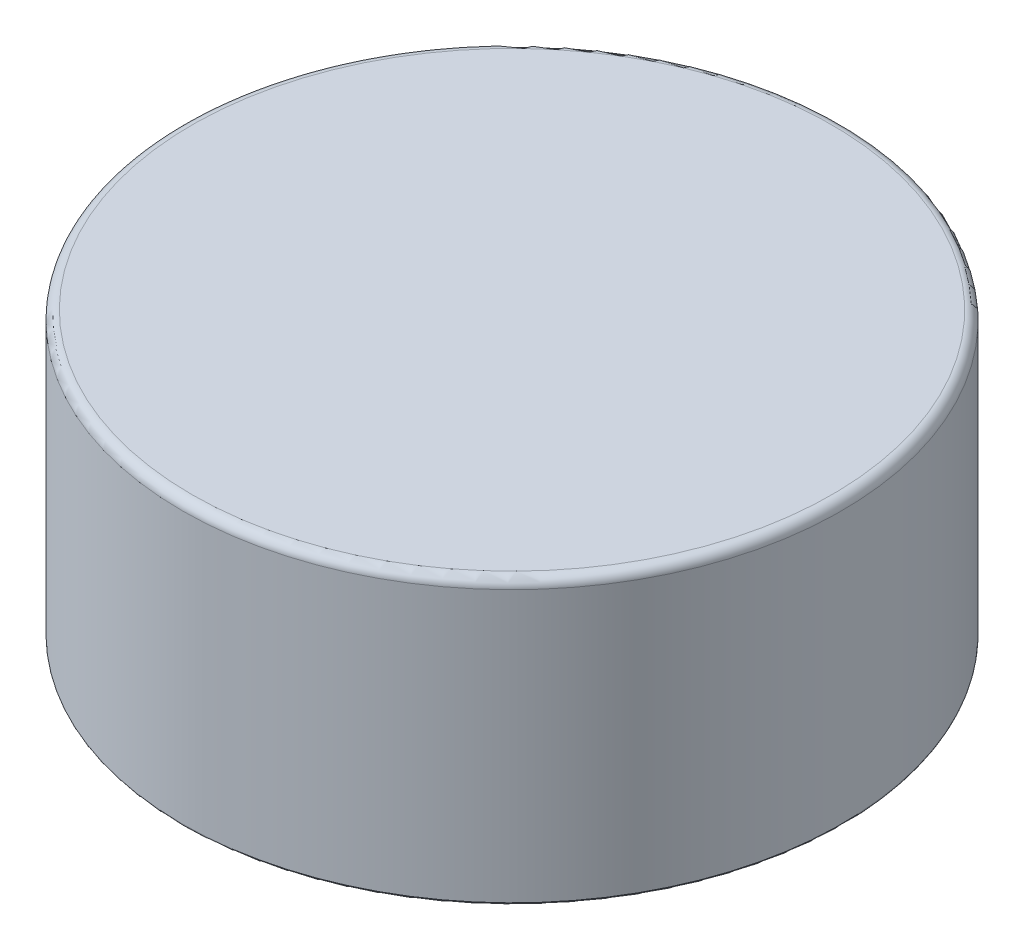
ISO-10303-21;
HEADER;
FILE_DESCRIPTION(('STEP AP214'),'2;1');
FILE_NAME('part.step','',(''),(''),'','','');
FILE_SCHEMA(('AUTOMOTIVE_DESIGN { 1 0 10303 214 1 1 1 1 }'));
ENDSEC;
DATA;
#1=APPLICATION_CONTEXT('core data for automotive mechanical design processes');
#2=APPLICATION_PROTOCOL_DEFINITION('international standard','automotive_design',2000,#1);
#3=PRODUCT_CONTEXT('',#1,'mechanical');
#4=PRODUCT('Part','Part','',(#3));
#5=PRODUCT_RELATED_PRODUCT_CATEGORY('part','',(#4));
#6=PRODUCT_DEFINITION_FORMATION('','',#4);
#7=PRODUCT_DEFINITION_CONTEXT('part definition',#1,'design');
#8=PRODUCT_DEFINITION('design','',#6,#7);
#9=PRODUCT_DEFINITION_SHAPE('','',#8);
#10=(LENGTH_UNIT() NAMED_UNIT(*) SI_UNIT(.MILLI.,.METRE.));
#11=(NAMED_UNIT(*) PLANE_ANGLE_UNIT() SI_UNIT($,.RADIAN.));
#12=(NAMED_UNIT(*) SI_UNIT($,.STERADIAN.) SOLID_ANGLE_UNIT());
#13=UNCERTAINTY_MEASURE_WITH_UNIT(LENGTH_MEASURE(1.E-05),#10,'distance_accuracy_value','');
#14=(GEOMETRIC_REPRESENTATION_CONTEXT(3) GLOBAL_UNCERTAINTY_ASSIGNED_CONTEXT((#13)) GLOBAL_UNIT_ASSIGNED_CONTEXT((#10,
#11,#12)) REPRESENTATION_CONTEXT('',''));
#15=CARTESIAN_POINT('',(0.,0.,0.));
#16=DIRECTION('',(0.,0.,1.));
#17=DIRECTION('',(1.,0.,0.));
#18=AXIS2_PLACEMENT_3D('',#15,#16,#17);
#19=CARTESIAN_POINT('',(0.,0.,0.));
#20=DIRECTION('',(0.,1.,0.));
#21=DIRECTION('',(0.,0.,1.));
#22=AXIS2_PLACEMENT_3D('',#19,#20,#21);
#23=PLANE('',#22);
#24=CARTESIAN_POINT('',(0.,0.,0.));
#25=DIRECTION('',(0.,1.,0.));
#26=DIRECTION('',(0.,0.,1.));
#27=AXIS2_PLACEMENT_3D('',#24,#25,#26);
#28=CIRCLE('',#27,34.8);
#29=CARTESIAN_POINT('',(0.,0.,34.8));
#30=VERTEX_POINT('',#29);
#31=EDGE_CURVE('E10',#30,#30,#28,.F.);
#32=ORIENTED_EDGE('',*,*,#31,.T.);
#33=EDGE_LOOP('',(#32));
#34=FACE_BOUND('',#33,.T.);
#35=CARTESIAN_POINT('',(0.,0.,0.));
#36=DIRECTION('',(0.,1.,0.));
#37=DIRECTION('',(0.,0.,1.));
#38=AXIS2_PLACEMENT_3D('',#35,#36,#37);
#39=CIRCLE('',#38,34.3);
#40=CARTESIAN_POINT('',(0.,0.,34.3));
#41=VERTEX_POINT('',#40);
#42=EDGE_CURVE('E56',#41,#41,#39,.T.);
#43=ORIENTED_EDGE('',*,*,#42,.T.);
#44=EDGE_LOOP('',(#43));
#45=FACE_BOUND('',#44,.T.);
#46=ADVANCED_FACE('F35',(#34,#45),#23,.F.);
#47=CARTESIAN_POINT('',(0.,30.,0.));
#48=DIRECTION('',(0.,-1.,0.));
#49=DIRECTION('',(0.,0.,-1.));
#50=AXIS2_PLACEMENT_3D('',#47,#48,#49);
#51=CYLINDRICAL_SURFACE('',#50,35.);
#52=CARTESIAN_POINT('',(0.,0.199999999999999,0.));
#53=DIRECTION('',(0.,1.,0.));
#54=DIRECTION('',(0.,0.,1.));
#55=AXIS2_PLACEMENT_3D('',#52,#53,#54);
#56=CIRCLE('',#55,35.);
#57=CARTESIAN_POINT('',(0.,0.199999999999999,35.));
#58=VERTEX_POINT('',#57);
#59=EDGE_CURVE('E42',#58,#58,#56,.T.);
#60=ORIENTED_EDGE('',*,*,#59,.T.);
#61=EDGE_LOOP('',(#60));
#62=FACE_BOUND('',#61,.T.);
#63=CARTESIAN_POINT('',(0.,29.,0.));
#64=DIRECTION('',(0.,1.,0.));
#65=DIRECTION('',(0.,0.,1.));
#66=AXIS2_PLACEMENT_3D('',#63,#64,#65);
#67=CIRCLE('',#66,35.);
#68=CARTESIAN_POINT('',(0.,29.,35.));
#69=VERTEX_POINT('',#68);
#70=EDGE_CURVE('E46',#69,#69,#67,.F.);
#71=ORIENTED_EDGE('',*,*,#70,.T.);
#72=EDGE_LOOP('',(#71));
#73=FACE_BOUND('',#72,.T.);
#74=ADVANCED_FACE('F77',(#62,#73),#51,.T.);
#75=CARTESIAN_POINT('',(0.,30.,0.));
#76=DIRECTION('',(0.,1.,0.));
#77=DIRECTION('',(0.,0.,1.));
#78=AXIS2_PLACEMENT_3D('',#75,#76,#77);
#79=PLANE('',#78);
#80=CARTESIAN_POINT('',(0.,30.,0.));
#81=DIRECTION('',(0.,1.,0.));
#82=DIRECTION('',(0.,0.,1.));
#83=AXIS2_PLACEMENT_3D('',#80,#81,#82);
#84=CIRCLE('',#83,34.);
#85=CARTESIAN_POINT('',(0.,30.,34.));
#86=VERTEX_POINT('',#85);
#87=EDGE_CURVE('E50',#86,#86,#84,.T.);
#88=ORIENTED_EDGE('',*,*,#87,.T.);
#89=EDGE_LOOP('',(#88));
#90=FACE_BOUND('',#89,.T.);
#91=ADVANCED_FACE('F74',(#90),#79,.T.);
#92=CARTESIAN_POINT('',(0.,25.,0.));
#93=DIRECTION('',(0.,-1.,0.));
#94=DIRECTION('',(0.,0.,-1.));
#95=AXIS2_PLACEMENT_3D('',#92,#93,#94);
#96=CYLINDRICAL_SURFACE('',#95,34.3);
#97=CARTESIAN_POINT('',(0.,25.,0.));
#98=DIRECTION('',(0.,1.,0.));
#99=DIRECTION('',(0.,0.,1.));
#100=AXIS2_PLACEMENT_3D('',#97,#98,#99);
#101=CIRCLE('',#100,34.3);
#102=CARTESIAN_POINT('',(0.,25.,34.3));
#103=VERTEX_POINT('',#102);
#104=EDGE_CURVE('E55',#103,#103,#101,.T.);
#105=ORIENTED_EDGE('',*,*,#104,.T.);
#106=EDGE_LOOP('',(#105));
#107=FACE_BOUND('',#106,.T.);
#108=ORIENTED_EDGE('',*,*,#42,.F.);
#109=EDGE_LOOP('',(#108));
#110=FACE_BOUND('',#109,.T.);
#111=ADVANCED_FACE('F62',(#107,#110),#96,.F.);
#112=CARTESIAN_POINT('',(0.,25.,0.));
#113=DIRECTION('',(0.,1.,0.));
#114=DIRECTION('',(0.,0.,1.));
#115=AXIS2_PLACEMENT_3D('',#112,#113,#114);
#116=PLANE('',#115);
#117=ORIENTED_EDGE('',*,*,#104,.F.);
#118=EDGE_LOOP('',(#117));
#119=FACE_BOUND('',#118,.T.);
#120=ADVANCED_FACE('F65',(#119),#116,.F.);
#121=CARTESIAN_POINT('',(0.,29.,0.));
#122=DIRECTION('',(0.,1.,0.));
#123=DIRECTION('',(0.,0.,1.));
#124=AXIS2_PLACEMENT_3D('',#121,#122,#123);
#125=TOROIDAL_SURFACE('',#124,34.,1.);
#126=ORIENTED_EDGE('',*,*,#70,.F.);
#127=EDGE_LOOP('',(#126));
#128=FACE_BOUND('',#127,.T.);
#129=ORIENTED_EDGE('',*,*,#87,.F.);
#130=EDGE_LOOP('',(#129));
#131=FACE_BOUND('',#130,.T.);
#132=ADVANCED_FACE('F67',(#128,#131),#125,.T.);
#133=CARTESIAN_POINT('',(0.,0.199999999999999,0.));
#134=DIRECTION('',(0.,1.,0.));
#135=DIRECTION('',(0.,0.,1.));
#136=AXIS2_PLACEMENT_3D('',#133,#134,#135);
#137=TOROIDAL_SURFACE('',#136,34.8,0.2);
#138=ORIENTED_EDGE('',*,*,#31,.F.);
#139=EDGE_LOOP('',(#138));
#140=FACE_BOUND('',#139,.T.);
#141=ORIENTED_EDGE('',*,*,#59,.F.);
#142=EDGE_LOOP('',(#141));
#143=FACE_BOUND('',#142,.T.);
#144=ADVANCED_FACE('F37',(#140,#143),#137,.T.);
#145=CLOSED_SHELL('',(#46,#74,#91,#111,#120,#132,#144));
#146=MANIFOLD_SOLID_BREP('B2',#145);
#147=ADVANCED_BREP_SHAPE_REPRESENTATION('',(#18,#146),#14);
#148=SHAPE_DEFINITION_REPRESENTATION(#9,#147);
ENDSEC;
END-ISO-10303-21;
